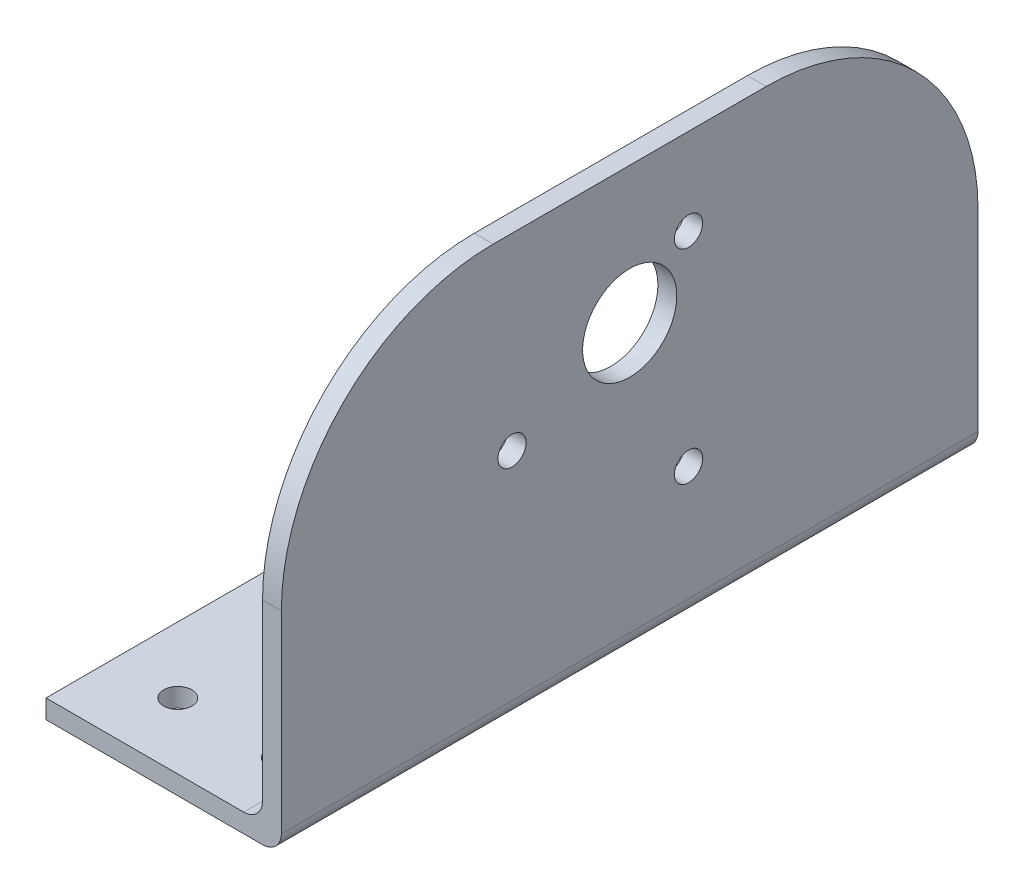
ISO-10303-21;
HEADER;
FILE_DESCRIPTION(('STEP AP214'),'2;1');
FILE_NAME('part.step','',(''),(''),'','','');
FILE_SCHEMA(('AUTOMOTIVE_DESIGN { 1 0 10303 214 1 1 1 1 }'));
ENDSEC;
DATA;
#1=APPLICATION_CONTEXT('core data for automotive mechanical design processes');
#2=APPLICATION_PROTOCOL_DEFINITION('international standard','automotive_design',2000,#1);
#3=PRODUCT_CONTEXT('',#1,'mechanical');
#4=PRODUCT('Part','Part','',(#3));
#5=PRODUCT_RELATED_PRODUCT_CATEGORY('part','',(#4));
#6=PRODUCT_DEFINITION_FORMATION('','',#4);
#7=PRODUCT_DEFINITION_CONTEXT('part definition',#1,'design');
#8=PRODUCT_DEFINITION('design','',#6,#7);
#9=PRODUCT_DEFINITION_SHAPE('','',#8);
#10=(LENGTH_UNIT() NAMED_UNIT(*) SI_UNIT(.MILLI.,.METRE.));
#11=(NAMED_UNIT(*) PLANE_ANGLE_UNIT() SI_UNIT($,.RADIAN.));
#12=(NAMED_UNIT(*) SI_UNIT($,.STERADIAN.) SOLID_ANGLE_UNIT());
#13=UNCERTAINTY_MEASURE_WITH_UNIT(LENGTH_MEASURE(1.E-05),#10,'distance_accuracy_value','');
#14=(GEOMETRIC_REPRESENTATION_CONTEXT(3) GLOBAL_UNCERTAINTY_ASSIGNED_CONTEXT((#13)) GLOBAL_UNIT_ASSIGNED_CONTEXT((#10,
#11,#12)) REPRESENTATION_CONTEXT('',''));
#15=CARTESIAN_POINT('',(0.,0.,0.));
#16=DIRECTION('',(0.,0.,1.));
#17=DIRECTION('',(1.,0.,0.));
#18=AXIS2_PLACEMENT_3D('',#15,#16,#17);
#19=CARTESIAN_POINT('',(0.,22.5,-14.5));
#20=DIRECTION('',(1.,0.,0.));
#21=DIRECTION('',(0.,0.,-1.));
#22=AXIS2_PLACEMENT_3D('',#19,#20,#21);
#23=PLANE('',#22);
#24=CARTESIAN_POINT('',(0.,24.9999999999998,12.4999999999999));
#25=DIRECTION('',(1.,0.,0.));
#26=DIRECTION('',(0.,0.,-1.));
#27=AXIS2_PLACEMENT_3D('',#24,#25,#26);
#28=CIRCLE('',#27,1.5);
#29=CARTESIAN_POINT('',(0.,24.9999999999998,10.9999999999999));
#30=VERTEX_POINT('',#29);
#31=EDGE_CURVE('E214',#30,#30,#28,.T.);
#32=ORIENTED_EDGE('',*,*,#31,.T.);
#33=EDGE_LOOP('',(#32));
#34=FACE_BOUND('',#33,.T.);
#35=CARTESIAN_POINT('',(0.,14.1746824526946,-6.24999999999998));
#36=DIRECTION('',(1.,0.,0.));
#37=DIRECTION('',(0.,0.,-1.));
#38=AXIS2_PLACEMENT_3D('',#35,#36,#37);
#39=CIRCLE('',#38,1.5);
#40=CARTESIAN_POINT('',(0.,14.1746824526946,-7.74999999999998));
#41=VERTEX_POINT('',#40);
#42=EDGE_CURVE('E208',#41,#41,#39,.T.);
#43=ORIENTED_EDGE('',*,*,#42,.T.);
#44=EDGE_LOOP('',(#43));
#45=FACE_BOUND('',#44,.T.);
#46=CARTESIAN_POINT('',(0.,30.5,0.));
#47=DIRECTION('',(1.,0.,0.));
#48=DIRECTION('',(0.,0.,-1.));
#49=AXIS2_PLACEMENT_3D('',#46,#47,#48);
#50=CIRCLE('',#49,5.);
#51=CARTESIAN_POINT('',(0.,30.5,-5.));
#52=VERTEX_POINT('',#51);
#53=EDGE_CURVE('E202',#52,#52,#50,.T.);
#54=ORIENTED_EDGE('',*,*,#53,.T.);
#55=EDGE_LOOP('',(#54));
#56=FACE_BOUND('',#55,.T.);
#57=CARTESIAN_POINT('',(0.,35.8253175473055,-6.24999999999993));
#58=DIRECTION('',(1.,0.,0.));
#59=DIRECTION('',(0.,0.,-1.));
#60=AXIS2_PLACEMENT_3D('',#57,#58,#59);
#61=CIRCLE('',#60,1.50000000000003);
#62=CARTESIAN_POINT('',(0.,35.8253175473055,-7.74999999999996));
#63=VERTEX_POINT('',#62);
#64=EDGE_CURVE('E131',#63,#63,#61,.T.);
#65=ORIENTED_EDGE('',*,*,#64,.T.);
#66=EDGE_LOOP('',(#65));
#67=FACE_BOUND('',#66,.T.);
#68=DIRECTION('',(0.,1.,0.));
#69=VECTOR('',#68,1.);
#70=CARTESIAN_POINT('',(0.,22.5,-37.));
#71=LINE('',#70,#69);
#72=CARTESIAN_POINT('',(0.,4.,-37.));
#73=VERTEX_POINT('',#72);
#74=CARTESIAN_POINT('',(0.,22.5,-37.));
#75=VERTEX_POINT('',#74);
#76=EDGE_CURVE('E151',#73,#75,#71,.T.);
#77=ORIENTED_EDGE('',*,*,#76,.F.);
#78=DIRECTION('',(0.,0.,-1.));
#79=VECTOR('',#78,1.);
#80=CARTESIAN_POINT('',(0.,4.,37.));
#81=LINE('',#80,#79);
#82=CARTESIAN_POINT('',(0.,4.,37.));
#83=VERTEX_POINT('',#82);
#84=EDGE_CURVE('E149',#73,#83,#81,.F.);
#85=ORIENTED_EDGE('',*,*,#84,.T.);
#86=DIRECTION('',(0.,-1.,0.));
#87=VECTOR('',#86,1.);
#88=CARTESIAN_POINT('',(0.,22.5,37.));
#89=LINE('',#88,#87);
#90=CARTESIAN_POINT('',(0.,22.5,37.));
#91=VERTEX_POINT('',#90);
#92=EDGE_CURVE('E155',#91,#83,#89,.T.);
#93=ORIENTED_EDGE('',*,*,#92,.F.);
#94=CARTESIAN_POINT('',(0.,22.5,14.5));
#95=DIRECTION('',(1.,0.,0.));
#96=DIRECTION('',(0.,0.,1.));
#97=AXIS2_PLACEMENT_3D('',#94,#95,#96);
#98=CIRCLE('',#97,22.5);
#99=CARTESIAN_POINT('',(0.,45.,14.5));
#100=VERTEX_POINT('',#99);
#101=EDGE_CURVE('E178',#100,#91,#98,.T.);
#102=ORIENTED_EDGE('',*,*,#101,.F.);
#103=DIRECTION('',(0.,0.,1.));
#104=VECTOR('',#103,1.);
#105=CARTESIAN_POINT('',(0.,45.,14.5));
#106=LINE('',#105,#104);
#107=CARTESIAN_POINT('',(0.,45.,-14.5));
#108=VERTEX_POINT('',#107);
#109=EDGE_CURVE('E139',#108,#100,#106,.T.);
#110=ORIENTED_EDGE('',*,*,#109,.F.);
#111=CARTESIAN_POINT('',(0.,22.5,-14.5));
#112=DIRECTION('',(1.,0.,0.));
#113=DIRECTION('',(0.,0.,-1.));
#114=AXIS2_PLACEMENT_3D('',#111,#112,#113);
#115=CIRCLE('',#114,22.5);
#116=EDGE_CURVE('E136',#75,#108,#115,.T.);
#117=ORIENTED_EDGE('',*,*,#116,.F.);
#118=EDGE_LOOP('',(#77,#85,#93,#102,#110,#117));
#119=FACE_BOUND('',#118,.T.);
#120=ADVANCED_FACE('F32',(#34,#45,#56,#67,#119),#23,.F.);
#121=CARTESIAN_POINT('',(2.,22.5,-14.5));
#122=DIRECTION('',(-1.,0.,0.));
#123=DIRECTION('',(0.,0.,1.));
#124=AXIS2_PLACEMENT_3D('',#121,#122,#123);
#125=CYLINDRICAL_SURFACE('',#124,22.5);
#126=ORIENTED_EDGE('',*,*,#116,.T.);
#127=DIRECTION('',(-1.,0.,0.));
#128=VECTOR('',#127,1.);
#129=CARTESIAN_POINT('',(2.,45.,-14.5));
#130=LINE('',#129,#128);
#131=CARTESIAN_POINT('',(2.,45.,-14.5));
#132=VERTEX_POINT('',#131);
#133=EDGE_CURVE('E150',#132,#108,#130,.T.);
#134=ORIENTED_EDGE('',*,*,#133,.F.);
#135=CARTESIAN_POINT('',(2.,22.5,-14.5));
#136=DIRECTION('',(1.,0.,0.));
#137=DIRECTION('',(0.,0.,-1.));
#138=AXIS2_PLACEMENT_3D('',#135,#136,#137);
#139=CIRCLE('',#138,22.5);
#140=CARTESIAN_POINT('',(2.,22.5,-37.));
#141=VERTEX_POINT('',#140);
#142=EDGE_CURVE('E154',#141,#132,#139,.T.);
#143=ORIENTED_EDGE('',*,*,#142,.F.);
#144=DIRECTION('',(-1.,0.,0.));
#145=VECTOR('',#144,1.);
#146=CARTESIAN_POINT('',(2.,22.5,-37.));
#147=LINE('',#146,#145);
#148=EDGE_CURVE('E162',#141,#75,#147,.T.);
#149=ORIENTED_EDGE('',*,*,#148,.T.);
#150=EDGE_LOOP('',(#126,#134,#143,#149));
#151=FACE_BOUND('',#150,.T.);
#152=ADVANCED_FACE('F252',(#151),#125,.T.);
#153=CARTESIAN_POINT('',(2.,45.,14.5));
#154=DIRECTION('',(0.,-1.,0.));
#155=DIRECTION('',(0.,0.,-1.));
#156=AXIS2_PLACEMENT_3D('',#153,#154,#155);
#157=PLANE('',#156);
#158=ORIENTED_EDGE('',*,*,#109,.T.);
#159=DIRECTION('',(-1.,0.,0.));
#160=VECTOR('',#159,1.);
#161=CARTESIAN_POINT('',(2.,45.,14.5));
#162=LINE('',#161,#160);
#163=CARTESIAN_POINT('',(2.,45.,14.5));
#164=VERTEX_POINT('',#163);
#165=EDGE_CURVE('E173',#164,#100,#162,.T.);
#166=ORIENTED_EDGE('',*,*,#165,.F.);
#167=DIRECTION('',(0.,0.,1.));
#168=VECTOR('',#167,1.);
#169=CARTESIAN_POINT('',(2.,45.,14.5));
#170=LINE('',#169,#168);
#171=EDGE_CURVE('E191',#132,#164,#170,.T.);
#172=ORIENTED_EDGE('',*,*,#171,.F.);
#173=ORIENTED_EDGE('',*,*,#133,.T.);
#174=EDGE_LOOP('',(#158,#166,#172,#173));
#175=FACE_BOUND('',#174,.T.);
#176=ADVANCED_FACE('F258',(#175),#157,.F.);
#177=CARTESIAN_POINT('',(2.,22.5,14.5));
#178=DIRECTION('',(-1.,0.,0.));
#179=DIRECTION('',(0.,0.,1.));
#180=AXIS2_PLACEMENT_3D('',#177,#178,#179);
#181=CYLINDRICAL_SURFACE('',#180,22.5);
#182=ORIENTED_EDGE('',*,*,#101,.T.);
#183=DIRECTION('',(-1.,0.,0.));
#184=VECTOR('',#183,1.);
#185=CARTESIAN_POINT('',(2.,22.5,37.));
#186=LINE('',#185,#184);
#187=CARTESIAN_POINT('',(2.,22.5,37.));
#188=VERTEX_POINT('',#187);
#189=EDGE_CURVE('E170',#188,#91,#186,.T.);
#190=ORIENTED_EDGE('',*,*,#189,.F.);
#191=CARTESIAN_POINT('',(2.,22.5,14.5));
#192=DIRECTION('',(1.,0.,0.));
#193=DIRECTION('',(0.,0.,1.));
#194=AXIS2_PLACEMENT_3D('',#191,#192,#193);
#195=CIRCLE('',#194,22.5);
#196=EDGE_CURVE('E189',#164,#188,#195,.T.);
#197=ORIENTED_EDGE('',*,*,#196,.F.);
#198=ORIENTED_EDGE('',*,*,#165,.T.);
#199=EDGE_LOOP('',(#182,#190,#197,#198));
#200=FACE_BOUND('',#199,.T.);
#201=ADVANCED_FACE('F275',(#200),#181,.T.);
#202=CARTESIAN_POINT('',(2.,22.5,37.));
#203=DIRECTION('',(0.,0.,-1.));
#204=DIRECTION('',(0.,1.,0.));
#205=AXIS2_PLACEMENT_3D('',#202,#203,#204);
#206=PLANE('',#205);
#207=DIRECTION('',(-1.,0.,0.));
#208=VECTOR('',#207,1.);
#209=CARTESIAN_POINT('',(2.,0.,37.));
#210=LINE('',#209,#208);
#211=CARTESIAN_POINT('',(0.,0.,37.));
#212=VERTEX_POINT('',#211);
#213=CARTESIAN_POINT('',(-23.,0.,37.));
#214=VERTEX_POINT('',#213);
#215=EDGE_CURVE('E168',#212,#214,#210,.T.);
#216=ORIENTED_EDGE('',*,*,#215,.F.);
#217=CARTESIAN_POINT('',(0.,2.,37.));
#218=DIRECTION('',(0.,0.,-1.));
#219=DIRECTION('',(0.,1.,0.));
#220=AXIS2_PLACEMENT_3D('',#217,#218,#219);
#221=CIRCLE('',#220,2.);
#222=CARTESIAN_POINT('',(2.,2.,37.));
#223=VERTEX_POINT('',#222);
#224=EDGE_CURVE('E294',#212,#223,#221,.F.);
#225=ORIENTED_EDGE('',*,*,#224,.T.);
#226=DIRECTION('',(0.,-1.,0.));
#227=VECTOR('',#226,1.);
#228=CARTESIAN_POINT('',(2.,22.5,37.));
#229=LINE('',#228,#227);
#230=EDGE_CURVE('E186',#188,#223,#229,.T.);
#231=ORIENTED_EDGE('',*,*,#230,.F.);
#232=ORIENTED_EDGE('',*,*,#189,.T.);
#233=ORIENTED_EDGE('',*,*,#92,.T.);
#234=CARTESIAN_POINT('',(-2.,4.,37.));
#235=DIRECTION('',(0.,0.,-1.));
#236=DIRECTION('',(0.,1.,0.));
#237=AXIS2_PLACEMENT_3D('',#234,#235,#236);
#238=CIRCLE('',#237,2.);
#239=CARTESIAN_POINT('',(-2.,2.,37.));
#240=VERTEX_POINT('',#239);
#241=EDGE_CURVE('E11',#83,#240,#238,.T.);
#242=ORIENTED_EDGE('',*,*,#241,.T.);
#243=DIRECTION('',(1.,0.,0.));
#244=VECTOR('',#243,1.);
#245=CARTESIAN_POINT('',(-23.,2.,37.));
#246=LINE('',#245,#244);
#247=CARTESIAN_POINT('',(-23.,2.,37.));
#248=VERTEX_POINT('',#247);
#249=EDGE_CURVE('E115',#248,#240,#246,.T.);
#250=ORIENTED_EDGE('',*,*,#249,.F.);
#251=DIRECTION('',(0.,1.,0.));
#252=VECTOR('',#251,1.);
#253=CARTESIAN_POINT('',(-23.,0.,37.));
#254=LINE('',#253,#252);
#255=EDGE_CURVE('E123',#214,#248,#254,.T.);
#256=ORIENTED_EDGE('',*,*,#255,.F.);
#257=EDGE_LOOP('',(#216,#225,#231,#232,#233,#242,#250,#256));
#258=FACE_BOUND('',#257,.T.);
#259=ADVANCED_FACE('F133',(#258),#206,.F.);
#260=CARTESIAN_POINT('',(2.,0.,-37.));
#261=DIRECTION('',(0.,1.,0.));
#262=DIRECTION('',(0.,0.,1.));
#263=AXIS2_PLACEMENT_3D('',#260,#261,#262);
#264=PLANE('',#263);
#265=CARTESIAN_POINT('',(-16.,0.,30.));
#266=DIRECTION('',(0.,-1.,0.));
#267=DIRECTION('',(0.,0.,1.));
#268=AXIS2_PLACEMENT_3D('',#265,#266,#267);
#269=CIRCLE('',#268,1.5);
#270=CARTESIAN_POINT('',(-16.,0.,31.5));
#271=VERTEX_POINT('',#270);
#272=EDGE_CURVE('E232',#271,#271,#269,.T.);
#273=ORIENTED_EDGE('',*,*,#272,.F.);
#274=EDGE_LOOP('',(#273));
#275=FACE_BOUND('',#274,.T.);
#276=CARTESIAN_POINT('',(-5.,0.,30.));
#277=DIRECTION('',(0.,-1.,0.));
#278=DIRECTION('',(0.,0.,1.));
#279=AXIS2_PLACEMENT_3D('',#276,#277,#278);
#280=CIRCLE('',#279,1.5);
#281=CARTESIAN_POINT('',(-5.,0.,31.5));
#282=VERTEX_POINT('',#281);
#283=EDGE_CURVE('E229',#282,#282,#280,.T.);
#284=ORIENTED_EDGE('',*,*,#283,.F.);
#285=EDGE_LOOP('',(#284));
#286=FACE_BOUND('',#285,.T.);
#287=CARTESIAN_POINT('',(-5.,0.,-30.));
#288=DIRECTION('',(0.,-1.,0.));
#289=DIRECTION('',(0.,0.,-1.));
#290=AXIS2_PLACEMENT_3D('',#287,#288,#289);
#291=CIRCLE('',#290,1.5);
#292=CARTESIAN_POINT('',(-5.,0.,-31.5));
#293=VERTEX_POINT('',#292);
#294=EDGE_CURVE('E225',#293,#293,#291,.T.);
#295=ORIENTED_EDGE('',*,*,#294,.F.);
#296=EDGE_LOOP('',(#295));
#297=FACE_BOUND('',#296,.T.);
#298=CARTESIAN_POINT('',(-16.,0.,-30.));
#299=DIRECTION('',(0.,-1.,0.));
#300=DIRECTION('',(0.,0.,-1.));
#301=AXIS2_PLACEMENT_3D('',#298,#299,#300);
#302=CIRCLE('',#301,1.5);
#303=CARTESIAN_POINT('',(-16.,0.,-31.5));
#304=VERTEX_POINT('',#303);
#305=EDGE_CURVE('E221',#304,#304,#302,.T.);
#306=ORIENTED_EDGE('',*,*,#305,.F.);
#307=EDGE_LOOP('',(#306));
#308=FACE_BOUND('',#307,.T.);
#309=DIRECTION('',(-1.,0.,0.));
#310=VECTOR('',#309,1.);
#311=CARTESIAN_POINT('',(2.,0.,-37.));
#312=LINE('',#311,#310);
#313=CARTESIAN_POINT('',(0.,0.,-37.));
#314=VERTEX_POINT('',#313);
#315=CARTESIAN_POINT('',(-23.,0.,-37.));
#316=VERTEX_POINT('',#315);
#317=EDGE_CURVE('E165',#314,#316,#312,.T.);
#318=ORIENTED_EDGE('',*,*,#317,.F.);
#319=DIRECTION('',(0.,0.,-1.));
#320=VECTOR('',#319,1.);
#321=CARTESIAN_POINT('',(0.,0.,37.));
#322=LINE('',#321,#320);
#323=EDGE_CURVE('E49',#314,#212,#322,.F.);
#324=ORIENTED_EDGE('',*,*,#323,.T.);
#325=ORIENTED_EDGE('',*,*,#215,.T.);
#326=DIRECTION('',(0.,0.,1.));
#327=VECTOR('',#326,1.);
#328=CARTESIAN_POINT('',(-23.,0.,37.));
#329=LINE('',#328,#327);
#330=EDGE_CURVE('E129',#316,#214,#329,.T.);
#331=ORIENTED_EDGE('',*,*,#330,.F.);
#332=EDGE_LOOP('',(#318,#324,#325,#331));
#333=FACE_BOUND('',#332,.T.);
#334=ADVANCED_FACE('F269',(#275,#286,#297,#308,#333),#264,.F.);
#335=CARTESIAN_POINT('',(2.,22.5,-37.));
#336=DIRECTION('',(0.,0.,1.));
#337=DIRECTION('',(0.,-1.,0.));
#338=AXIS2_PLACEMENT_3D('',#335,#336,#337);
#339=PLANE('',#338);
#340=DIRECTION('',(0.,1.,0.));
#341=VECTOR('',#340,1.);
#342=CARTESIAN_POINT('',(2.,22.5,-37.));
#343=LINE('',#342,#341);
#344=CARTESIAN_POINT('',(2.,2.00000000000001,-37.));
#345=VERTEX_POINT('',#344);
#346=EDGE_CURVE('E166',#345,#141,#343,.T.);
#347=ORIENTED_EDGE('',*,*,#346,.F.);
#348=CARTESIAN_POINT('',(0.,2.,-37.));
#349=DIRECTION('',(0.,0.,1.));
#350=DIRECTION('',(0.,-1.,0.));
#351=AXIS2_PLACEMENT_3D('',#348,#349,#350);
#352=CIRCLE('',#351,2.);
#353=EDGE_CURVE('E57',#345,#314,#352,.F.);
#354=ORIENTED_EDGE('',*,*,#353,.T.);
#355=ORIENTED_EDGE('',*,*,#317,.T.);
#356=DIRECTION('',(0.,-1.,0.));
#357=VECTOR('',#356,1.);
#358=CARTESIAN_POINT('',(-23.,0.,-37.));
#359=LINE('',#358,#357);
#360=CARTESIAN_POINT('',(-23.,1.99999999999999,-37.));
#361=VERTEX_POINT('',#360);
#362=EDGE_CURVE('E122',#361,#316,#359,.T.);
#363=ORIENTED_EDGE('',*,*,#362,.F.);
#364=DIRECTION('',(1.,0.,0.));
#365=VECTOR('',#364,1.);
#366=CARTESIAN_POINT('',(-23.,1.99999999999999,-37.));
#367=LINE('',#366,#365);
#368=CARTESIAN_POINT('',(-2.,1.99999999999999,-37.));
#369=VERTEX_POINT('',#368);
#370=EDGE_CURVE('E118',#361,#369,#367,.T.);
#371=ORIENTED_EDGE('',*,*,#370,.T.);
#372=CARTESIAN_POINT('',(-2.,3.99999999999999,-37.));
#373=DIRECTION('',(0.,0.,1.));
#374=DIRECTION('',(0.,-1.,0.));
#375=AXIS2_PLACEMENT_3D('',#372,#373,#374);
#376=CIRCLE('',#375,2.);
#377=EDGE_CURVE('E41',#369,#73,#376,.T.);
#378=ORIENTED_EDGE('',*,*,#377,.T.);
#379=ORIENTED_EDGE('',*,*,#76,.T.);
#380=ORIENTED_EDGE('',*,*,#148,.F.);
#381=EDGE_LOOP('',(#347,#354,#355,#363,#371,#378,#379,#380));
#382=FACE_BOUND('',#381,.T.);
#383=ADVANCED_FACE('F266',(#382),#339,.F.);
#384=CARTESIAN_POINT('',(2.,22.5,-14.5));
#385=DIRECTION('',(1.,0.,0.));
#386=DIRECTION('',(0.,0.,-1.));
#387=AXIS2_PLACEMENT_3D('',#384,#385,#386);
#388=PLANE('',#387);
#389=CARTESIAN_POINT('',(2.,24.9999999999998,12.4999999999999));
#390=DIRECTION('',(1.,0.,0.));
#391=DIRECTION('',(0.,0.,-1.));
#392=AXIS2_PLACEMENT_3D('',#389,#390,#391);
#393=CIRCLE('',#392,1.5);
#394=CARTESIAN_POINT('',(2.,24.9999999999998,10.9999999999999));
#395=VERTEX_POINT('',#394);
#396=EDGE_CURVE('E217',#395,#395,#393,.T.);
#397=ORIENTED_EDGE('',*,*,#396,.F.);
#398=EDGE_LOOP('',(#397));
#399=FACE_BOUND('',#398,.T.);
#400=CARTESIAN_POINT('',(2.,14.1746824526946,-6.24999999999998));
#401=DIRECTION('',(1.,0.,0.));
#402=DIRECTION('',(0.,0.,-1.));
#403=AXIS2_PLACEMENT_3D('',#400,#401,#402);
#404=CIRCLE('',#403,1.5);
#405=CARTESIAN_POINT('',(2.,14.1746824526946,-7.74999999999998));
#406=VERTEX_POINT('',#405);
#407=EDGE_CURVE('E211',#406,#406,#404,.T.);
#408=ORIENTED_EDGE('',*,*,#407,.F.);
#409=EDGE_LOOP('',(#408));
#410=FACE_BOUND('',#409,.T.);
#411=CARTESIAN_POINT('',(2.,30.5,0.));
#412=DIRECTION('',(1.,0.,0.));
#413=DIRECTION('',(0.,0.,-1.));
#414=AXIS2_PLACEMENT_3D('',#411,#412,#413);
#415=CIRCLE('',#414,5.);
#416=CARTESIAN_POINT('',(2.,30.5,-5.));
#417=VERTEX_POINT('',#416);
#418=EDGE_CURVE('E205',#417,#417,#415,.T.);
#419=ORIENTED_EDGE('',*,*,#418,.F.);
#420=EDGE_LOOP('',(#419));
#421=FACE_BOUND('',#420,.T.);
#422=CARTESIAN_POINT('',(2.,35.8253175473055,-6.24999999999993));
#423=DIRECTION('',(1.,0.,0.));
#424=DIRECTION('',(0.,0.,-1.));
#425=AXIS2_PLACEMENT_3D('',#422,#423,#424);
#426=CIRCLE('',#425,1.50000000000003);
#427=CARTESIAN_POINT('',(2.,35.8253175473055,-7.74999999999996));
#428=VERTEX_POINT('',#427);
#429=EDGE_CURVE('E199',#428,#428,#426,.T.);
#430=ORIENTED_EDGE('',*,*,#429,.F.);
#431=EDGE_LOOP('',(#430));
#432=FACE_BOUND('',#431,.T.);
#433=ORIENTED_EDGE('',*,*,#230,.T.);
#434=DIRECTION('',(0.,0.,-1.));
#435=VECTOR('',#434,1.);
#436=CARTESIAN_POINT('',(2.,2.,-37.));
#437=LINE('',#436,#435);
#438=EDGE_CURVE('E297',#223,#345,#437,.T.);
#439=ORIENTED_EDGE('',*,*,#438,.T.);
#440=ORIENTED_EDGE('',*,*,#346,.T.);
#441=ORIENTED_EDGE('',*,*,#142,.T.);
#442=ORIENTED_EDGE('',*,*,#171,.T.);
#443=ORIENTED_EDGE('',*,*,#196,.T.);
#444=EDGE_LOOP('',(#433,#439,#440,#441,#442,#443));
#445=FACE_BOUND('',#444,.T.);
#446=ADVANCED_FACE('F264',(#399,#410,#421,#432,#445),#388,.T.);
#447=CARTESIAN_POINT('',(-23.,2.,37.));
#448=DIRECTION('',(0.,-1.,0.));
#449=DIRECTION('',(0.,0.,-1.));
#450=AXIS2_PLACEMENT_3D('',#447,#448,#449);
#451=PLANE('',#450);
#452=CARTESIAN_POINT('',(-16.,2.,30.));
#453=DIRECTION('',(0.,-1.,0.));
#454=DIRECTION('',(0.,0.,-1.));
#455=AXIS2_PLACEMENT_3D('',#452,#453,#454);
#456=CIRCLE('',#455,1.5);
#457=CARTESIAN_POINT('',(-16.,2.,28.5));
#458=VERTEX_POINT('',#457);
#459=EDGE_CURVE('E36',#458,#458,#456,.T.);
#460=ORIENTED_EDGE('',*,*,#459,.T.);
#461=EDGE_LOOP('',(#460));
#462=FACE_BOUND('',#461,.T.);
#463=CARTESIAN_POINT('',(-5.,2.,30.));
#464=DIRECTION('',(0.,-1.,0.));
#465=DIRECTION('',(0.,0.,-1.));
#466=AXIS2_PLACEMENT_3D('',#463,#464,#465);
#467=CIRCLE('',#466,1.5);
#468=CARTESIAN_POINT('',(-5.,2.,28.5));
#469=VERTEX_POINT('',#468);
#470=EDGE_CURVE('E228',#469,#469,#467,.T.);
#471=ORIENTED_EDGE('',*,*,#470,.T.);
#472=EDGE_LOOP('',(#471));
#473=FACE_BOUND('',#472,.T.);
#474=CARTESIAN_POINT('',(-5.,1.99999999999999,-30.));
#475=DIRECTION('',(0.,-1.,0.));
#476=DIRECTION('',(0.,0.,-1.));
#477=AXIS2_PLACEMENT_3D('',#474,#475,#476);
#478=CIRCLE('',#477,1.5);
#479=CARTESIAN_POINT('',(-5.,1.99999999999999,-31.5));
#480=VERTEX_POINT('',#479);
#481=EDGE_CURVE('E224',#480,#480,#478,.T.);
#482=ORIENTED_EDGE('',*,*,#481,.T.);
#483=EDGE_LOOP('',(#482));
#484=FACE_BOUND('',#483,.T.);
#485=CARTESIAN_POINT('',(-16.,1.99999999999999,-30.));
#486=DIRECTION('',(0.,-1.,0.));
#487=DIRECTION('',(0.,0.,-1.));
#488=AXIS2_PLACEMENT_3D('',#485,#486,#487);
#489=CIRCLE('',#488,1.5);
#490=CARTESIAN_POINT('',(-16.,1.99999999999999,-31.5));
#491=VERTEX_POINT('',#490);
#492=EDGE_CURVE('E220',#491,#491,#489,.T.);
#493=ORIENTED_EDGE('',*,*,#492,.T.);
#494=EDGE_LOOP('',(#493));
#495=FACE_BOUND('',#494,.T.);
#496=ORIENTED_EDGE('',*,*,#249,.T.);
#497=DIRECTION('',(0.,0.,-1.));
#498=VECTOR('',#497,1.);
#499=CARTESIAN_POINT('',(-2.,1.99999999999999,-37.));
#500=LINE('',#499,#498);
#501=EDGE_CURVE('E147',#240,#369,#500,.T.);
#502=ORIENTED_EDGE('',*,*,#501,.T.);
#503=ORIENTED_EDGE('',*,*,#370,.F.);
#504=DIRECTION('',(0.,0.,-1.));
#505=VECTOR('',#504,1.);
#506=CARTESIAN_POINT('',(-23.,2.,37.));
#507=LINE('',#506,#505);
#508=EDGE_CURVE('E110',#248,#361,#507,.T.);
#509=ORIENTED_EDGE('',*,*,#508,.F.);
#510=EDGE_LOOP('',(#496,#502,#503,#509));
#511=FACE_BOUND('',#510,.T.);
#512=ADVANCED_FACE('F112',(#462,#473,#484,#495,#511),#451,.F.);
#513=CARTESIAN_POINT('',(-23.,2.,37.));
#514=DIRECTION('',(-1.,0.,0.));
#515=DIRECTION('',(0.,0.,1.));
#516=AXIS2_PLACEMENT_3D('',#513,#514,#515);
#517=PLANE('',#516);
#518=ORIENTED_EDGE('',*,*,#255,.T.);
#519=ORIENTED_EDGE('',*,*,#508,.T.);
#520=ORIENTED_EDGE('',*,*,#362,.T.);
#521=ORIENTED_EDGE('',*,*,#330,.T.);
#522=EDGE_LOOP('',(#518,#519,#520,#521));
#523=FACE_BOUND('',#522,.T.);
#524=ADVANCED_FACE('F127',(#523),#517,.T.);
#525=CARTESIAN_POINT('',(-2.,4.,37.));
#526=DIRECTION('',(0.,0.,1.));
#527=DIRECTION('',(0.,-1.,0.));
#528=AXIS2_PLACEMENT_3D('',#525,#526,#527);
#529=CYLINDRICAL_SURFACE('',#528,2.);
#530=ORIENTED_EDGE('',*,*,#241,.F.);
#531=ORIENTED_EDGE('',*,*,#84,.F.);
#532=ORIENTED_EDGE('',*,*,#377,.F.);
#533=ORIENTED_EDGE('',*,*,#501,.F.);
#534=EDGE_LOOP('',(#530,#531,#532,#533));
#535=FACE_BOUND('',#534,.T.);
#536=ADVANCED_FACE('F280',(#535),#529,.F.);
#537=CARTESIAN_POINT('',(0.,2.,-14.5));
#538=DIRECTION('',(0.,0.,1.));
#539=DIRECTION('',(1.,0.,0.));
#540=AXIS2_PLACEMENT_3D('',#537,#538,#539);
#541=CYLINDRICAL_SURFACE('',#540,2.);
#542=ORIENTED_EDGE('',*,*,#224,.F.);
#543=ORIENTED_EDGE('',*,*,#323,.F.);
#544=ORIENTED_EDGE('',*,*,#353,.F.);
#545=ORIENTED_EDGE('',*,*,#438,.F.);
#546=EDGE_LOOP('',(#542,#543,#544,#545));
#547=FACE_BOUND('',#546,.T.);
#548=ADVANCED_FACE('F34',(#547),#541,.T.);
#549=CARTESIAN_POINT('',(-23.,35.8253175473055,-6.24999999999993));
#550=DIRECTION('',(1.,0.,0.));
#551=DIRECTION('',(0.,0.,-1.));
#552=AXIS2_PLACEMENT_3D('',#549,#550,#551);
#553=CYLINDRICAL_SURFACE('',#552,1.50000000000003);
#554=ORIENTED_EDGE('',*,*,#429,.T.);
#555=EDGE_LOOP('',(#554));
#556=FACE_BOUND('',#555,.T.);
#557=ORIENTED_EDGE('',*,*,#64,.F.);
#558=EDGE_LOOP('',(#557));
#559=FACE_BOUND('',#558,.T.);
#560=ADVANCED_FACE('F287',(#556,#559),#553,.F.);
#561=CARTESIAN_POINT('',(-23.,30.5,0.));
#562=DIRECTION('',(1.,0.,0.));
#563=DIRECTION('',(0.,0.,-1.));
#564=AXIS2_PLACEMENT_3D('',#561,#562,#563);
#565=CYLINDRICAL_SURFACE('',#564,5.);
#566=ORIENTED_EDGE('',*,*,#418,.T.);
#567=EDGE_LOOP('',(#566));
#568=FACE_BOUND('',#567,.T.);
#569=ORIENTED_EDGE('',*,*,#53,.F.);
#570=EDGE_LOOP('',(#569));
#571=FACE_BOUND('',#570,.T.);
#572=ADVANCED_FACE('F332',(#568,#571),#565,.F.);
#573=CARTESIAN_POINT('',(-23.,14.1746824526946,-6.24999999999998));
#574=DIRECTION('',(1.,0.,0.));
#575=DIRECTION('',(0.,0.,-1.));
#576=AXIS2_PLACEMENT_3D('',#573,#574,#575);
#577=CYLINDRICAL_SURFACE('',#576,1.5);
#578=ORIENTED_EDGE('',*,*,#407,.T.);
#579=EDGE_LOOP('',(#578));
#580=FACE_BOUND('',#579,.T.);
#581=ORIENTED_EDGE('',*,*,#42,.F.);
#582=EDGE_LOOP('',(#581));
#583=FACE_BOUND('',#582,.T.);
#584=ADVANCED_FACE('F326',(#580,#583),#577,.F.);
#585=CARTESIAN_POINT('',(-23.,24.9999999999998,12.4999999999999));
#586=DIRECTION('',(1.,0.,0.));
#587=DIRECTION('',(0.,0.,-1.));
#588=AXIS2_PLACEMENT_3D('',#585,#586,#587);
#589=CYLINDRICAL_SURFACE('',#588,1.5);
#590=ORIENTED_EDGE('',*,*,#396,.T.);
#591=EDGE_LOOP('',(#590));
#592=FACE_BOUND('',#591,.T.);
#593=ORIENTED_EDGE('',*,*,#31,.F.);
#594=EDGE_LOOP('',(#593));
#595=FACE_BOUND('',#594,.T.);
#596=ADVANCED_FACE('F317',(#592,#595),#589,.F.);
#597=CARTESIAN_POINT('',(-16.,45.,-30.));
#598=DIRECTION('',(0.,-1.,0.));
#599=DIRECTION('',(0.,0.,-1.));
#600=AXIS2_PLACEMENT_3D('',#597,#598,#599);
#601=CYLINDRICAL_SURFACE('',#600,1.5);
#602=ORIENTED_EDGE('',*,*,#305,.T.);
#603=EDGE_LOOP('',(#602));
#604=FACE_BOUND('',#603,.T.);
#605=ORIENTED_EDGE('',*,*,#492,.F.);
#606=EDGE_LOOP('',(#605));
#607=FACE_BOUND('',#606,.T.);
#608=ADVANCED_FACE('F315',(#604,#607),#601,.F.);
#609=CARTESIAN_POINT('',(-5.,45.,-30.));
#610=DIRECTION('',(0.,-1.,0.));
#611=DIRECTION('',(0.,0.,-1.));
#612=AXIS2_PLACEMENT_3D('',#609,#610,#611);
#613=CYLINDRICAL_SURFACE('',#612,1.5);
#614=ORIENTED_EDGE('',*,*,#294,.T.);
#615=EDGE_LOOP('',(#614));
#616=FACE_BOUND('',#615,.T.);
#617=ORIENTED_EDGE('',*,*,#481,.F.);
#618=EDGE_LOOP('',(#617));
#619=FACE_BOUND('',#618,.T.);
#620=ADVANCED_FACE('F248',(#616,#619),#613,.F.);
#621=CARTESIAN_POINT('',(-5.,45.,30.));
#622=DIRECTION('',(0.,-1.,0.));
#623=DIRECTION('',(0.,0.,-1.));
#624=AXIS2_PLACEMENT_3D('',#621,#622,#623);
#625=CYLINDRICAL_SURFACE('',#624,1.5);
#626=ORIENTED_EDGE('',*,*,#283,.T.);
#627=EDGE_LOOP('',(#626));
#628=FACE_BOUND('',#627,.T.);
#629=ORIENTED_EDGE('',*,*,#470,.F.);
#630=EDGE_LOOP('',(#629));
#631=FACE_BOUND('',#630,.T.);
#632=ADVANCED_FACE('F243',(#628,#631),#625,.F.);
#633=CARTESIAN_POINT('',(-16.,45.,30.));
#634=DIRECTION('',(0.,-1.,0.));
#635=DIRECTION('',(0.,0.,-1.));
#636=AXIS2_PLACEMENT_3D('',#633,#634,#635);
#637=CYLINDRICAL_SURFACE('',#636,1.5);
#638=ORIENTED_EDGE('',*,*,#272,.T.);
#639=EDGE_LOOP('',(#638));
#640=FACE_BOUND('',#639,.T.);
#641=ORIENTED_EDGE('',*,*,#459,.F.);
#642=EDGE_LOOP('',(#641));
#643=FACE_BOUND('',#642,.T.);
#644=ADVANCED_FACE('F241',(#640,#643),#637,.F.);
#645=CLOSED_SHELL('',(#120,#152,#176,#201,#259,#334,#383,#446,#512,#524,#536,#548,#560,#572,
#584,#596,#608,#620,#632,#644));
#646=MANIFOLD_SOLID_BREP('B2',#645);
#647=ADVANCED_BREP_SHAPE_REPRESENTATION('',(#18,#646),#14);
#648=SHAPE_DEFINITION_REPRESENTATION(#9,#647);
ENDSEC;
END-ISO-10303-21;
